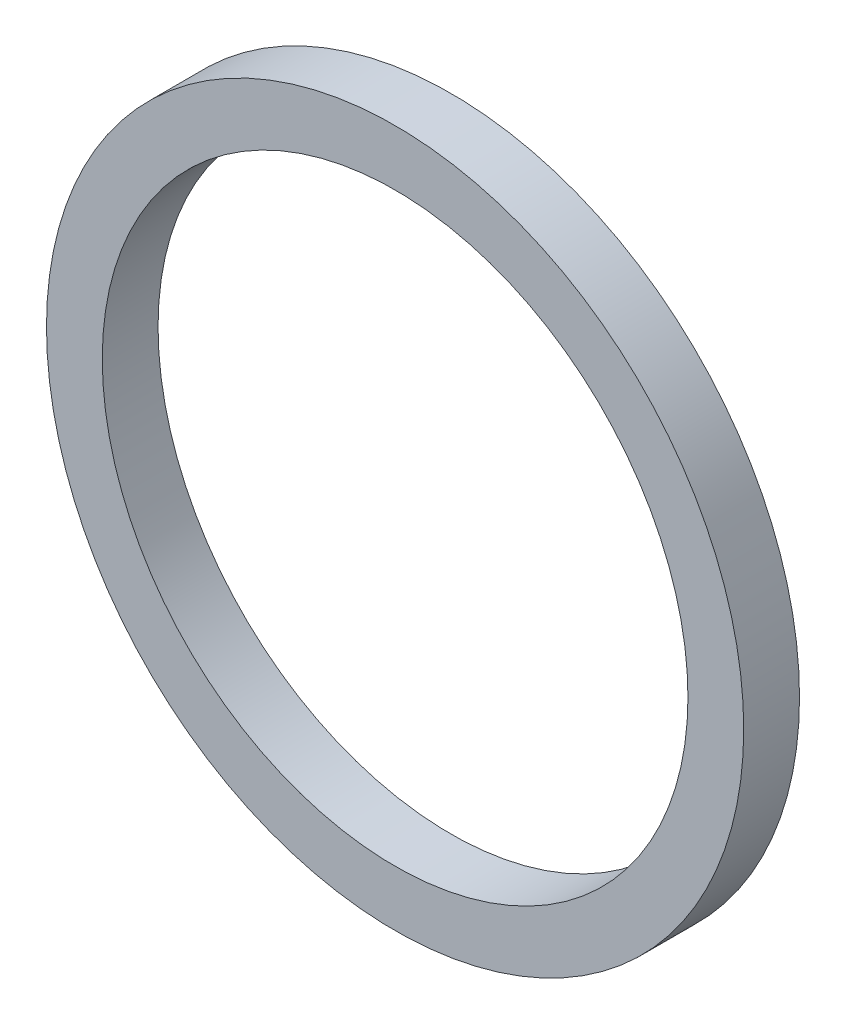
ISO-10303-21;
HEADER;
FILE_DESCRIPTION(('STEP AP214'),'2;1');
FILE_NAME('part.step','',(''),(''),'','','');
FILE_SCHEMA(('AUTOMOTIVE_DESIGN { 1 0 10303 214 1 1 1 1 }'));
ENDSEC;
DATA;
#1=APPLICATION_CONTEXT('core data for automotive mechanical design processes');
#2=APPLICATION_PROTOCOL_DEFINITION('international standard','automotive_design',2000,#1);
#3=PRODUCT_CONTEXT('',#1,'mechanical');
#4=PRODUCT('Part','Part','',(#3));
#5=PRODUCT_RELATED_PRODUCT_CATEGORY('part','',(#4));
#6=PRODUCT_DEFINITION_FORMATION('','',#4);
#7=PRODUCT_DEFINITION_CONTEXT('part definition',#1,'design');
#8=PRODUCT_DEFINITION('design','',#6,#7);
#9=PRODUCT_DEFINITION_SHAPE('','',#8);
#10=(LENGTH_UNIT() NAMED_UNIT(*) SI_UNIT(.MILLI.,.METRE.));
#11=(NAMED_UNIT(*) PLANE_ANGLE_UNIT() SI_UNIT($,.RADIAN.));
#12=(NAMED_UNIT(*) SI_UNIT($,.STERADIAN.) SOLID_ANGLE_UNIT());
#13=UNCERTAINTY_MEASURE_WITH_UNIT(LENGTH_MEASURE(1.E-05),#10,'distance_accuracy_value','');
#14=(GEOMETRIC_REPRESENTATION_CONTEXT(3) GLOBAL_UNCERTAINTY_ASSIGNED_CONTEXT((#13)) GLOBAL_UNIT_ASSIGNED_CONTEXT((#10,
#11,#12)) REPRESENTATION_CONTEXT('',''));
#15=CARTESIAN_POINT('',(0.,0.,0.));
#16=DIRECTION('',(0.,0.,1.));
#17=DIRECTION('',(1.,0.,0.));
#18=AXIS2_PLACEMENT_3D('',#15,#16,#17);
#19=CARTESIAN_POINT('',(0.,0.,3.));
#20=DIRECTION('',(0.,0.,1.));
#21=DIRECTION('',(1.,0.,0.));
#22=AXIS2_PLACEMENT_3D('',#19,#20,#21);
#23=PLANE('',#22);
#24=CARTESIAN_POINT('',(0.,0.,3.));
#25=DIRECTION('',(0.,0.,1.));
#26=DIRECTION('',(1.,0.,0.));
#27=AXIS2_PLACEMENT_3D('',#24,#25,#26);
#28=CIRCLE('',#27,18.75);
#29=CARTESIAN_POINT('',(18.75,0.,3.));
#30=VERTEX_POINT('',#29);
#31=EDGE_CURVE('E10',#30,#30,#28,.T.);
#32=ORIENTED_EDGE('',*,*,#31,.T.);
#33=EDGE_LOOP('',(#32));
#34=FACE_BOUND('',#33,.T.);
#35=CARTESIAN_POINT('',(0.,0.,3.));
#36=DIRECTION('',(0.,0.,1.));
#37=DIRECTION('',(1.,0.,0.));
#38=AXIS2_PLACEMENT_3D('',#35,#36,#37);
#39=CIRCLE('',#38,15.75);
#40=CARTESIAN_POINT('',(15.75,0.,3.));
#41=VERTEX_POINT('',#40);
#42=EDGE_CURVE('E48',#41,#41,#39,.T.);
#43=ORIENTED_EDGE('',*,*,#42,.F.);
#44=EDGE_LOOP('',(#43));
#45=FACE_BOUND('',#44,.T.);
#46=ADVANCED_FACE('F37',(#34,#45),#23,.T.);
#47=CARTESIAN_POINT('',(0.,0.,0.));
#48=DIRECTION('',(0.,0.,1.));
#49=DIRECTION('',(1.,0.,0.));
#50=AXIS2_PLACEMENT_3D('',#47,#48,#49);
#51=PLANE('',#50);
#52=CARTESIAN_POINT('',(0.,0.,0.));
#53=DIRECTION('',(0.,0.,1.));
#54=DIRECTION('',(1.,0.,0.));
#55=AXIS2_PLACEMENT_3D('',#52,#53,#54);
#56=CIRCLE('',#55,18.75);
#57=CARTESIAN_POINT('',(18.75,0.,0.));
#58=VERTEX_POINT('',#57);
#59=EDGE_CURVE('E41',#58,#58,#56,.T.);
#60=ORIENTED_EDGE('',*,*,#59,.F.);
#61=EDGE_LOOP('',(#60));
#62=FACE_BOUND('',#61,.T.);
#63=CARTESIAN_POINT('',(0.,0.,0.));
#64=DIRECTION('',(0.,0.,1.));
#65=DIRECTION('',(1.,0.,0.));
#66=AXIS2_PLACEMENT_3D('',#63,#64,#65);
#67=CIRCLE('',#66,15.75);
#68=CARTESIAN_POINT('',(15.75,0.,0.));
#69=VERTEX_POINT('',#68);
#70=EDGE_CURVE('E50',#69,#69,#67,.T.);
#71=ORIENTED_EDGE('',*,*,#70,.T.);
#72=EDGE_LOOP('',(#71));
#73=FACE_BOUND('',#72,.T.);
#74=ADVANCED_FACE('F60',(#62,#73),#51,.F.);
#75=CARTESIAN_POINT('',(0.,0.,3.));
#76=DIRECTION('',(0.,0.,-1.));
#77=DIRECTION('',(-1.,0.,0.));
#78=AXIS2_PLACEMENT_3D('',#75,#76,#77);
#79=CYLINDRICAL_SURFACE('',#78,18.75);
#80=ORIENTED_EDGE('',*,*,#31,.F.);
#81=EDGE_LOOP('',(#80));
#82=FACE_BOUND('',#81,.T.);
#83=ORIENTED_EDGE('',*,*,#59,.T.);
#84=EDGE_LOOP('',(#83));
#85=FACE_BOUND('',#84,.T.);
#86=ADVANCED_FACE('F39',(#82,#85),#79,.T.);
#87=CARTESIAN_POINT('',(0.,0.,3.));
#88=DIRECTION('',(0.,0.,-1.));
#89=DIRECTION('',(-1.,0.,0.));
#90=AXIS2_PLACEMENT_3D('',#87,#88,#89);
#91=CYLINDRICAL_SURFACE('',#90,15.75);
#92=ORIENTED_EDGE('',*,*,#42,.T.);
#93=EDGE_LOOP('',(#92));
#94=FACE_BOUND('',#93,.T.);
#95=ORIENTED_EDGE('',*,*,#70,.F.);
#96=EDGE_LOOP('',(#95));
#97=FACE_BOUND('',#96,.T.);
#98=ADVANCED_FACE('F56',(#94,#97),#91,.F.);
#99=CLOSED_SHELL('',(#46,#74,#86,#98));
#100=MANIFOLD_SOLID_BREP('B2',#99);
#101=ADVANCED_BREP_SHAPE_REPRESENTATION('',(#18,#100),#14);
#102=SHAPE_DEFINITION_REPRESENTATION(#9,#101);
ENDSEC;
END-ISO-10303-21;
